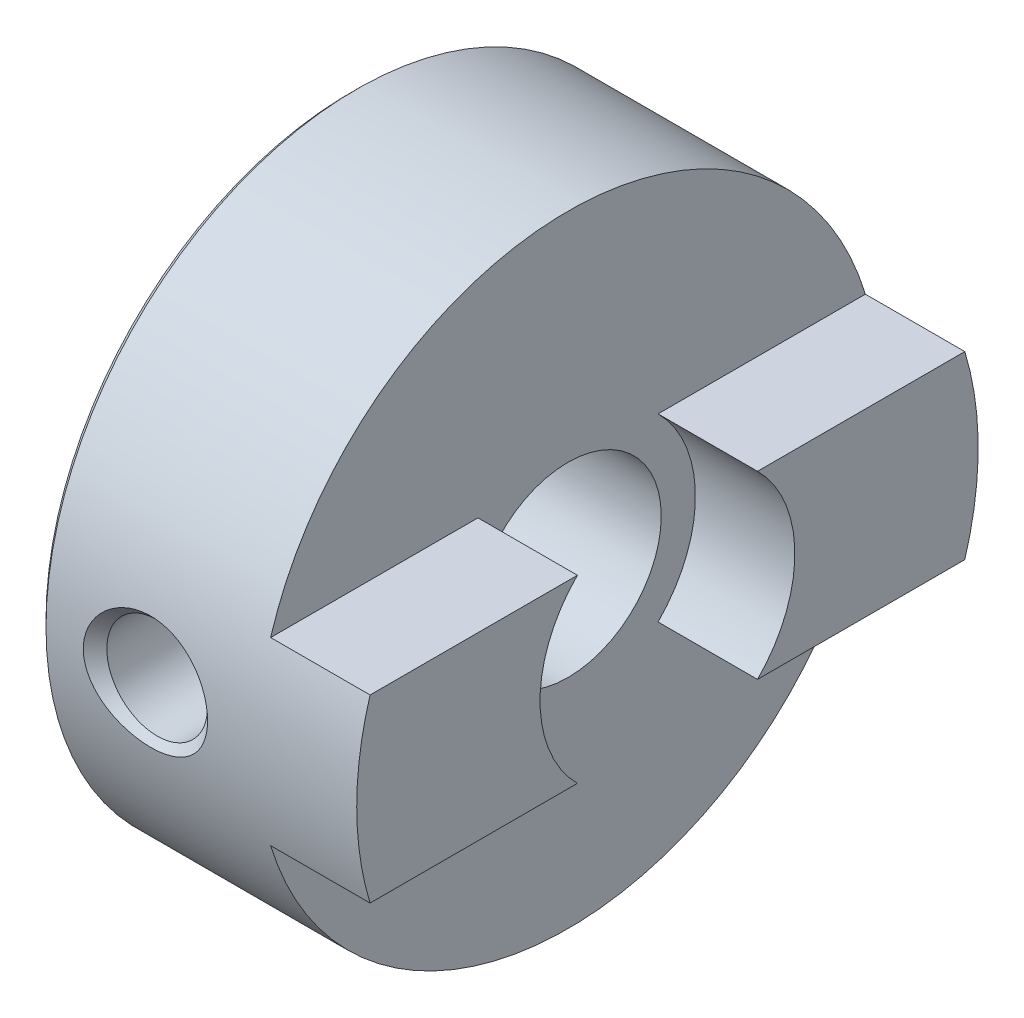
ISO-10303-21;
HEADER;
FILE_DESCRIPTION(('STEP AP214'),'2;1');
FILE_NAME('part.step','',(''),(''),'','','');
FILE_SCHEMA(('AUTOMOTIVE_DESIGN { 1 0 10303 214 1 1 1 1 }'));
ENDSEC;
DATA;
#1=APPLICATION_CONTEXT('core data for automotive mechanical design processes');
#2=APPLICATION_PROTOCOL_DEFINITION('international standard','automotive_design',2000,#1);
#3=PRODUCT_CONTEXT('',#1,'mechanical');
#4=PRODUCT('Part','Part','',(#3));
#5=PRODUCT_RELATED_PRODUCT_CATEGORY('part','',(#4));
#6=PRODUCT_DEFINITION_FORMATION('','',#4);
#7=PRODUCT_DEFINITION_CONTEXT('part definition',#1,'design');
#8=PRODUCT_DEFINITION('design','',#6,#7);
#9=PRODUCT_DEFINITION_SHAPE('','',#8);
#10=(LENGTH_UNIT() NAMED_UNIT(*) SI_UNIT(.MILLI.,.METRE.));
#11=(NAMED_UNIT(*) PLANE_ANGLE_UNIT() SI_UNIT($,.RADIAN.));
#12=(NAMED_UNIT(*) SI_UNIT($,.STERADIAN.) SOLID_ANGLE_UNIT());
#13=UNCERTAINTY_MEASURE_WITH_UNIT(LENGTH_MEASURE(1.E-05),#10,'distance_accuracy_value','');
#14=(GEOMETRIC_REPRESENTATION_CONTEXT(3) GLOBAL_UNCERTAINTY_ASSIGNED_CONTEXT((#13)) GLOBAL_UNIT_ASSIGNED_CONTEXT((#10,
#11,#12)) REPRESENTATION_CONTEXT('',''));
#15=CARTESIAN_POINT('',(0.,0.,0.));
#16=DIRECTION('',(0.,0.,1.));
#17=DIRECTION('',(1.,0.,0.));
#18=AXIS2_PLACEMENT_3D('',#15,#16,#17);
#19=CARTESIAN_POINT('',(10.2,0.,0.));
#20=DIRECTION('',(-1.,0.,0.));
#21=DIRECTION('',(0.,0.,1.));
#22=AXIS2_PLACEMENT_3D('',#19,#20,#21);
#23=CYLINDRICAL_SURFACE('',#22,10.);
#24=CARTESIAN_POINT('',(2.04203605263134,-1.34241325962392,9.90948670710666));
#25=CARTESIAN_POINT('',(2.11375542397122,-1.403240523465,9.90124691995362));
#26=CARTESIAN_POINT('',(2.18989182528834,-1.45890211933818,9.89313764082208));
#27=CARTESIAN_POINT('',(2.34925532035735,-1.55916960172842,9.8778320646358));
#28=CARTESIAN_POINT('',(2.43248860925503,-1.60376569319462,9.87063657919076));
#29=CARTESIAN_POINT('',(2.6219925848851,-1.68930210928572,9.85639502389072));
#30=CARTESIAN_POINT('',(2.72948553219465,-1.72761385701575,9.84968268006661));
#31=CARTESIAN_POINT('',(2.94933651346637,-1.78669335920088,9.83913761976317));
#32=CARTESIAN_POINT('',(3.0616966654432,-1.80745339356143,9.83530617052286));
#33=CARTESIAN_POINT('',(3.29308990862618,-1.83156785115371,9.83084559805247));
#34=CARTESIAN_POINT('',(3.41220590990035,-1.8341605770526,9.83035663452192));
#35=CARTESIAN_POINT('',(3.64922601441559,-1.81986799512386,9.83301223260815));
#36=CARTESIAN_POINT('',(3.76713003270237,-1.80298133114981,9.83615704720695));
#37=CARTESIAN_POINT('',(3.9996034290027,-1.7497602257805,9.84576428779239));
#38=CARTESIAN_POINT('',(4.11412681675671,-1.7132301395102,9.85226006178363));
#39=CARTESIAN_POINT('',(4.33516048902334,-1.62125375202364,9.86781136761335));
#40=CARTESIAN_POINT('',(4.44167025728316,-1.56580623338128,9.8768670641885));
#41=CARTESIAN_POINT('',(4.64111082233285,-1.43837265465425,9.89621846873361));
#42=CARTESIAN_POINT('',(4.7342751492373,-1.36674877708146,9.90648496446691));
#43=CARTESIAN_POINT('',(4.90614866938823,-1.20782961406183,9.92711143478405));
#44=CARTESIAN_POINT('',(4.98486323457534,-1.12054017651392,9.93747137312015));
#45=CARTESIAN_POINT('',(5.11980395338148,-0.938642082082796,9.95624141112421));
#46=CARTESIAN_POINT('',(5.17716449208623,-0.844885941486473,9.96473473462322));
#47=CARTESIAN_POINT('',(5.27349691200858,-0.648199010207064,9.97945483045475));
#48=CARTESIAN_POINT('',(5.3124837120208,-0.545275743915212,9.98568344070818));
#49=CARTESIAN_POINT('',(5.3671729789784,-0.343874247360195,9.9945446223789));
#50=CARTESIAN_POINT('',(5.38474953322585,-0.245915988420423,9.99746472104146));
#51=CARTESIAN_POINT('',(5.4022361149181,-0.0484041411381668,10.0003695536457));
#52=CARTESIAN_POINT('',(5.40215363738717,0.0511487524536561,10.000355532916));
#53=CARTESIAN_POINT('',(5.38489896220358,0.242476170784844,9.99748983101426));
#54=CARTESIAN_POINT('',(5.36878332134464,0.334351156623259,9.99481358692744));
#55=CARTESIAN_POINT('',(5.32176601831496,0.51412060714981,9.98718069962873));
#56=CARTESIAN_POINT('',(5.29086388026823,0.602014943628468,9.98222398302425));
#57=CARTESIAN_POINT('',(5.21493293386297,0.773019711530929,9.97045207609644));
#58=CARTESIAN_POINT('',(5.1696839939923,0.856029931496645,9.9636081583261));
#59=CARTESIAN_POINT('',(5.06689422375728,1.01392340385955,9.9487818170687));
#60=CARTESIAN_POINT('',(5.00934989283831,1.08880433263463,9.94079906956711));
#61=CARTESIAN_POINT('',(4.87894894150659,1.23447162688709,9.9238030932501));
#62=CARTESIAN_POINT('',(4.80525754097539,1.3045061687632,9.91475775416407));
#63=CARTESIAN_POINT('',(4.64794441919632,1.43240822380913,9.89708970173511));
#64=CARTESIAN_POINT('',(4.5643189231435,1.49027108863773,9.88846715081479));
#65=CARTESIAN_POINT('',(4.38153418471773,1.59752765702108,9.8717333045712));
#66=CARTESIAN_POINT('',(4.28165500297367,1.64571393946365,9.86373530170333));
#67=CARTESIAN_POINT('',(4.0754385309667,1.72585895137402,9.85002883016572));
#68=CARTESIAN_POINT('',(3.96909936359708,1.75781293865579,9.84432103066997));
#69=CARTESIAN_POINT('',(3.74621625177177,1.80638838383251,9.83552836788217));
#70=CARTESIAN_POINT('',(3.62944128411396,1.82198683566234,9.83261936137998));
#71=CARTESIAN_POINT('',(3.39486487494573,1.83412123663999,9.83036296012612));
#72=CARTESIAN_POINT('',(3.27706327585451,1.83065420601992,9.83101612211003));
#73=CARTESIAN_POINT('',(3.04119864761494,1.80444216325199,9.83586147731257));
#74=CARTESIAN_POINT('',(2.92318121054954,1.78129740459865,9.84012704833762));
#75=CARTESIAN_POINT('',(2.69280878150543,1.71561219037197,9.8517906665897));
#76=CARTESIAN_POINT('',(2.58045431638512,1.67306993382479,9.85918900467606));
#77=CARTESIAN_POINT('',(2.36581493938337,1.56983517700697,9.87614901728429));
#78=CARTESIAN_POINT('',(2.26344879419886,1.50930878895272,9.88569070578194));
#79=CARTESIAN_POINT('',(2.07108333350251,1.37112070640718,9.90580054499222));
#80=CARTESIAN_POINT('',(1.981081936517,1.29346190172542,9.91636852242754));
#81=CARTESIAN_POINT('',(1.82099876692076,1.12690342645504,9.93663756302797));
#82=CARTESIAN_POINT('',(1.75016033608861,1.03873541573407,9.94635578054492));
#83=CARTESIAN_POINT('',(1.62601158238275,0.850665231116957,9.96419833690671));
#84=CARTESIAN_POINT('',(1.57268827734222,0.750771822939427,9.97232385444711));
#85=CARTESIAN_POINT('',(1.49029274114702,0.551870768735924,9.98521137796381));
#86=CARTESIAN_POINT('',(1.45945480092119,0.453610249008211,9.99021223200516));
#87=CARTESIAN_POINT('',(1.41614576973022,0.253033165393579,9.99730024771955));
#88=CARTESIAN_POINT('',(1.40366301836498,0.150719218970854,9.99938925913892));
#89=CARTESIAN_POINT('',(1.39796920562316,-0.0460911958730754,10.0003387207038));
#90=CARTESIAN_POINT('',(1.40327326406868,-0.140546655337177,9.99944794550816));
#91=CARTESIAN_POINT('',(1.42967176301348,-0.327159425861631,9.9950825821691));
#92=CARTESIAN_POINT('',(1.45076629170412,-0.419316724083549,9.99160797959474));
#93=CARTESIAN_POINT('',(1.5074595833349,-0.597749488664115,9.98251470494415));
#94=CARTESIAN_POINT('',(1.54289103337312,-0.684079834897608,9.97692081156793));
#95=CARTESIAN_POINT('',(1.62683683955861,-0.849951171873044,9.96416112679107));
#96=CARTESIAN_POINT('',(1.67534805042054,-0.92949378881176,9.95699571337045));
#97=CARTESIAN_POINT('',(1.77446616135076,-1.06727958089582,9.94308117256719));
#98=CARTESIAN_POINT('',(1.82328764631752,-1.12683634457346,9.93647131377168));
#99=CARTESIAN_POINT('',(1.92776912327518,-1.23954884818016,9.92304079303933));
#100=CARTESIAN_POINT('',(1.98342774504566,-1.29270586645815,9.91622017354513));
#101=CARTESIAN_POINT('',(2.04203605263134,-1.34241325962392,9.90948670710666));
#102=B_SPLINE_CURVE_WITH_KNOTS('',3,(#24,#25,#26,#27,#28,#29,#30,#31,#32,#33,#34,#35,#36,#37,
#38,#39,#40,#41,#42,#43,#44,#45,#46,#47,#48,#49,#50,#51,#52,#53,#54,#55,#56,#57,#58,#59,#60,#61,
#62,#63,#64,#65,#66,#67,#68,#69,#70,#71,#72,#73,#74,#75,#76,#77,#78,#79,#80,#81,#82,#83,#84,#85,
#86,#87,#88,#89,#90,#91,#92,#93,#94,#95,#96,#97,#98,#99,#100,#101),.UNSPECIFIED.,.T.,.F.,(4,2,2,
2,2,2,2,2,2,2,2,2,2,2,2,2,2,2,2,2,2,2,2,2,2,2,2,2,2,2,2,2,2,2,2,2,2,2,4),(0.,0.282999987596324,
0.566249596778663,0.907629818392951,1.24916011757754,1.60492837412329,1.9607214005912,
2.3201255333534,2.6795527998328,3.03161485312538,3.38354575521571,3.7124512028387,
4.04108912935102,4.33821745723761,4.63521967517437,4.91386546974415,5.19252023261509,
5.47567624116556,5.75891297321336,6.06382400948452,6.36885128016056,6.70095008860706,
7.0331458623877,7.38506553177243,7.73704020468186,8.0963408157774,8.45567479317689,
8.81178779539873,9.16784077614117,9.5065530851701,9.84501377199465,10.1526644919369,
10.4601196877335,10.7425680964228,11.0250180826268,11.3042627819106,11.5834403911198,
11.8147512527918,12.0460158331962),.UNSPECIFIED.);
#103=CARTESIAN_POINT('',(2.04203605263134,-1.34241325962392,9.90948670710666));
#104=VERTEX_POINT('',#103);
#105=EDGE_CURVE('E43',#104,#104,#102,.T.);
#106=ORIENTED_EDGE('',*,*,#105,.F.);
#107=EDGE_LOOP('',(#106));
#108=FACE_BOUND('',#107,.T.);
#109=CARTESIAN_POINT('',(0.200000000000001,0.,0.));
#110=DIRECTION('',(-1.,0.,0.));
#111=DIRECTION('',(0.,0.,1.));
#112=AXIS2_PLACEMENT_3D('',#109,#110,#111);
#113=CIRCLE('',#112,10.);
#114=CARTESIAN_POINT('',(0.200000000000001,0.,10.));
#115=VERTEX_POINT('',#114);
#116=EDGE_CURVE('E144',#115,#115,#113,.T.);
#117=ORIENTED_EDGE('',*,*,#116,.F.);
#118=EDGE_LOOP('',(#117));
#119=FACE_BOUND('',#118,.T.);
#120=DIRECTION('',(-1.,0.,0.));
#121=VECTOR('',#120,1.);
#122=CARTESIAN_POINT('',(10.2,2.9,-9.57026645397086));
#123=LINE('',#122,#121);
#124=CARTESIAN_POINT('',(10.2,2.9,-9.57026645397086));
#125=VERTEX_POINT('',#124);
#126=CARTESIAN_POINT('',(7.,2.9,-9.57026645397086));
#127=VERTEX_POINT('',#126);
#128=EDGE_CURVE('E129',#125,#127,#123,.T.);
#129=ORIENTED_EDGE('',*,*,#128,.F.);
#130=CARTESIAN_POINT('',(10.2,0.,0.));
#131=DIRECTION('',(-1.,0.,0.));
#132=DIRECTION('',(0.,0.,1.));
#133=AXIS2_PLACEMENT_3D('',#130,#131,#132);
#134=CIRCLE('',#133,10.);
#135=CARTESIAN_POINT('',(10.2,-2.9,-9.57026645397086));
#136=VERTEX_POINT('',#135);
#137=EDGE_CURVE('E111',#125,#136,#134,.T.);
#138=ORIENTED_EDGE('',*,*,#137,.T.);
#139=DIRECTION('',(-1.,0.,0.));
#140=VECTOR('',#139,1.);
#141=CARTESIAN_POINT('',(10.2,-2.9,-9.57026645397086));
#142=LINE('',#141,#140);
#143=CARTESIAN_POINT('',(7.,-2.9,-9.57026645397086));
#144=VERTEX_POINT('',#143);
#145=EDGE_CURVE('E127',#144,#136,#142,.F.);
#146=ORIENTED_EDGE('',*,*,#145,.F.);
#147=CARTESIAN_POINT('',(7.,0.,0.));
#148=DIRECTION('',(1.,0.,0.));
#149=DIRECTION('',(0.,0.,-1.));
#150=AXIS2_PLACEMENT_3D('',#147,#148,#149);
#151=CIRCLE('',#150,10.);
#152=CARTESIAN_POINT('',(7.,-2.9,9.57026645397086));
#153=VERTEX_POINT('',#152);
#154=EDGE_CURVE('E125',#153,#144,#151,.T.);
#155=ORIENTED_EDGE('',*,*,#154,.F.);
#156=DIRECTION('',(-1.,0.,0.));
#157=VECTOR('',#156,1.);
#158=CARTESIAN_POINT('',(10.2,-2.9,9.57026645397086));
#159=LINE('',#158,#157);
#160=CARTESIAN_POINT('',(10.2,-2.9,9.57026645397086));
#161=VERTEX_POINT('',#160);
#162=EDGE_CURVE('E115',#161,#153,#159,.T.);
#163=ORIENTED_EDGE('',*,*,#162,.F.);
#164=CARTESIAN_POINT('',(10.2,2.9,9.57026645397086));
#165=VERTEX_POINT('',#164);
#166=EDGE_CURVE('E101',#161,#165,#134,.T.);
#167=ORIENTED_EDGE('',*,*,#166,.T.);
#168=DIRECTION('',(-1.,0.,0.));
#169=VECTOR('',#168,1.);
#170=CARTESIAN_POINT('',(10.2,2.9,9.57026645397086));
#171=LINE('',#170,#169);
#172=CARTESIAN_POINT('',(7.,2.9,9.57026645397086));
#173=VERTEX_POINT('',#172);
#174=EDGE_CURVE('E126',#173,#165,#171,.F.);
#175=ORIENTED_EDGE('',*,*,#174,.F.);
#176=EDGE_CURVE('E136',#127,#173,#151,.T.);
#177=ORIENTED_EDGE('',*,*,#176,.F.);
#178=EDGE_LOOP('',(#129,#138,#146,#155,#163,#167,#175,#177));
#179=FACE_BOUND('',#178,.T.);
#180=CARTESIAN_POINT('',(2.04203605263134,-9.90948670710666,-1.34241325962392));
#181=CARTESIAN_POINT('',(2.11375542397122,-9.90124691995362,-1.403240523465));
#182=CARTESIAN_POINT('',(2.18989182528834,-9.89313764082208,-1.45890211933818));
#183=CARTESIAN_POINT('',(2.34925532035735,-9.8778320646358,-1.55916960172842));
#184=CARTESIAN_POINT('',(2.43248860925503,-9.87063657919076,-1.60376569319462));
#185=CARTESIAN_POINT('',(2.6219925848851,-9.85639502389072,-1.68930210928572));
#186=CARTESIAN_POINT('',(2.72948553219465,-9.84968268006661,-1.72761385701576));
#187=CARTESIAN_POINT('',(2.94933651346637,-9.83913761976317,-1.78669335920088));
#188=CARTESIAN_POINT('',(3.0616966654432,-9.83530617052286,-1.80745339356143));
#189=CARTESIAN_POINT('',(3.29308990862618,-9.83084559805247,-1.83156785115371));
#190=CARTESIAN_POINT('',(3.41220590990035,-9.83035663452193,-1.8341605770526));
#191=CARTESIAN_POINT('',(3.64922601441559,-9.83301223260815,-1.81986799512386));
#192=CARTESIAN_POINT('',(3.76713003270237,-9.83615704720695,-1.80298133114981));
#193=CARTESIAN_POINT('',(3.9996034290027,-9.84576428779239,-1.7497602257805));
#194=CARTESIAN_POINT('',(4.11412681675671,-9.85226006178363,-1.7132301395102));
#195=CARTESIAN_POINT('',(4.33516048902334,-9.86781136761335,-1.62125375202364));
#196=CARTESIAN_POINT('',(4.44167025728316,-9.8768670641885,-1.56580623338127));
#197=CARTESIAN_POINT('',(4.64111082233285,-9.89621846873361,-1.43837265465425));
#198=CARTESIAN_POINT('',(4.7342751492373,-9.90648496446691,-1.36674877708145));
#199=CARTESIAN_POINT('',(4.90614866938823,-9.92711143478405,-1.20782961406183));
#200=CARTESIAN_POINT('',(4.98486323457534,-9.93747137312015,-1.12054017651392));
#201=CARTESIAN_POINT('',(5.11980395338148,-9.95624141112421,-0.938642082082795));
#202=CARTESIAN_POINT('',(5.17716449208623,-9.96473473462322,-0.844885941486473));
#203=CARTESIAN_POINT('',(5.27349691200858,-9.97945483045475,-0.648199010207063));
#204=CARTESIAN_POINT('',(5.3124837120208,-9.98568344070818,-0.54527574391521));
#205=CARTESIAN_POINT('',(5.3671729789784,-9.9945446223789,-0.343874247360193));
#206=CARTESIAN_POINT('',(5.38474953322585,-9.99746472104146,-0.245915988420421));
#207=CARTESIAN_POINT('',(5.4022361149181,-10.0003695536457,-0.0484041411381657));
#208=CARTESIAN_POINT('',(5.40215363738717,-10.000355532916,0.0511487524536571));
#209=CARTESIAN_POINT('',(5.38489896220358,-9.99748983101426,0.242476170784845));
#210=CARTESIAN_POINT('',(5.36878332134464,-9.99481358692744,0.33435115662326));
#211=CARTESIAN_POINT('',(5.32176601831496,-9.98718069962873,0.514120607149811));
#212=CARTESIAN_POINT('',(5.29086388026823,-9.98222398302425,0.602014943628468));
#213=CARTESIAN_POINT('',(5.21493293386297,-9.97045207609644,0.77301971153093));
#214=CARTESIAN_POINT('',(5.1696839939923,-9.9636081583261,0.856029931496645));
#215=CARTESIAN_POINT('',(5.06689422375728,-9.9487818170687,1.01392340385955));
#216=CARTESIAN_POINT('',(5.00934989283831,-9.94079906956711,1.08880433263462));
#217=CARTESIAN_POINT('',(4.87894894150659,-9.9238030932501,1.23447162688709));
#218=CARTESIAN_POINT('',(4.80525754097539,-9.91475775416407,1.30450616876321));
#219=CARTESIAN_POINT('',(4.64794441919632,-9.89708970173511,1.43240822380913));
#220=CARTESIAN_POINT('',(4.5643189231435,-9.88846715081479,1.49027108863773));
#221=CARTESIAN_POINT('',(4.38153418471773,-9.87173330457119,1.59752765702109));
#222=CARTESIAN_POINT('',(4.28165500297367,-9.86373530170333,1.64571393946365));
#223=CARTESIAN_POINT('',(4.0754385309667,-9.85002883016572,1.72585895137402));
#224=CARTESIAN_POINT('',(3.96909936359708,-9.84432103066997,1.75781293865579));
#225=CARTESIAN_POINT('',(3.74621625177177,-9.83552836788217,1.80638838383251));
#226=CARTESIAN_POINT('',(3.62944128411395,-9.83261936137998,1.82198683566234));
#227=CARTESIAN_POINT('',(3.39486487494573,-9.83036296012612,1.83412123663999));
#228=CARTESIAN_POINT('',(3.27706327585451,-9.83101612211003,1.83065420601992));
#229=CARTESIAN_POINT('',(3.04119864761494,-9.83586147731257,1.80444216325199));
#230=CARTESIAN_POINT('',(2.92318121054954,-9.84012704833762,1.78129740459865));
#231=CARTESIAN_POINT('',(2.69280878150543,-9.8517906665897,1.71561219037198));
#232=CARTESIAN_POINT('',(2.58045431638512,-9.85918900467606,1.67306993382479));
#233=CARTESIAN_POINT('',(2.36581493938337,-9.87614901728429,1.56983517700697));
#234=CARTESIAN_POINT('',(2.26344879419886,-9.88569070578194,1.50930878895272));
#235=CARTESIAN_POINT('',(2.07108333350251,-9.90580054499222,1.37112070640718));
#236=CARTESIAN_POINT('',(1.981081936517,-9.91636852242754,1.29346190172542));
#237=CARTESIAN_POINT('',(1.82099876692076,-9.93663756302797,1.12690342645504));
#238=CARTESIAN_POINT('',(1.75016033608861,-9.94635578054492,1.03873541573407));
#239=CARTESIAN_POINT('',(1.62601158238275,-9.96419833690671,0.850665231116957));
#240=CARTESIAN_POINT('',(1.57268827734222,-9.97232385444711,0.750771822939427));
#241=CARTESIAN_POINT('',(1.49029274114702,-9.98521137796381,0.551870768735924));
#242=CARTESIAN_POINT('',(1.45945480092119,-9.99021223200516,0.453610249008211));
#243=CARTESIAN_POINT('',(1.41614576973022,-9.99730024771955,0.253033165393579));
#244=CARTESIAN_POINT('',(1.40366301836498,-9.99938925913892,0.150719218970854));
#245=CARTESIAN_POINT('',(1.39796920562316,-10.0003387207038,-0.046091195873075));
#246=CARTESIAN_POINT('',(1.40327326406869,-9.99944794550816,-0.140546655337177));
#247=CARTESIAN_POINT('',(1.42967176301348,-9.9950825821691,-0.327159425861631));
#248=CARTESIAN_POINT('',(1.45076629170412,-9.99160797959474,-0.419316724083548));
#249=CARTESIAN_POINT('',(1.5074595833349,-9.98251470494415,-0.597749488664114));
#250=CARTESIAN_POINT('',(1.54289103337312,-9.97692081156793,-0.684079834897607));
#251=CARTESIAN_POINT('',(1.62683683955861,-9.96416112679107,-0.849951171873043));
#252=CARTESIAN_POINT('',(1.67534805042054,-9.95699571337045,-0.929493788811759));
#253=CARTESIAN_POINT('',(1.77446616135076,-9.94308117256719,-1.06727958089582));
#254=CARTESIAN_POINT('',(1.82328764631752,-9.93647131377168,-1.12683634457346));
#255=CARTESIAN_POINT('',(1.92776912327518,-9.92304079303933,-1.23954884818016));
#256=CARTESIAN_POINT('',(1.98342774504567,-9.91622017354513,-1.29270586645815));
#257=CARTESIAN_POINT('',(2.04203605263134,-9.90948670710666,-1.34241325962392));
#258=B_SPLINE_CURVE_WITH_KNOTS('',3,(#180,#181,#182,#183,#184,#185,#186,#187,#188,#189,#190,
#191,#192,#193,#194,#195,#196,#197,#198,#199,#200,#201,#202,#203,#204,#205,#206,#207,#208,#209,
#210,#211,#212,#213,#214,#215,#216,#217,#218,#219,#220,#221,#222,#223,#224,#225,#226,#227,#228,
#229,#230,#231,#232,#233,#234,#235,#236,#237,#238,#239,#240,#241,#242,#243,#244,#245,#246,#247,
#248,#249,#250,#251,#252,#253,#254,#255,#256,#257),.UNSPECIFIED.,.T.,.F.,(4,2,2,2,2,2,2,2,2,2,2,
2,2,2,2,2,2,2,2,2,2,2,2,2,2,2,2,2,2,2,2,2,2,2,2,2,2,2,4),(0.,0.282999987596324,
0.566249596778662,0.907629818392951,1.24916011757755,1.60492837412329,1.9607214005912,
2.3201255333534,2.67955279983281,3.03161485312538,3.38354575521571,3.7124512028387,
4.04108912935102,4.33821745723761,4.63521967517437,4.91386546974415,5.19252023261509,
5.47567624116556,5.75891297321336,6.06382400948452,6.36885128016056,6.70095008860706,
7.0331458623877,7.38506553177243,7.73704020468186,8.09634081577739,8.45567479317689,
8.81178779539872,9.16784077614116,9.5065530851701,9.84501377199464,10.1526644919369,
10.4601196877335,10.7425680964228,11.0250180826268,11.3042627819106,11.5834403911198,
11.8147512527918,12.0460158331962),.UNSPECIFIED.);
#259=CARTESIAN_POINT('',(2.04203605263134,-9.90948670710666,-1.34241325962392));
#260=VERTEX_POINT('',#259);
#261=EDGE_CURVE('E11',#260,#260,#258,.T.);
#262=ORIENTED_EDGE('',*,*,#261,.F.);
#263=EDGE_LOOP('',(#262));
#264=FACE_BOUND('',#263,.T.);
#265=ADVANCED_FACE('F31',(#108,#119,#179,#264),#23,.T.);
#266=CARTESIAN_POINT('',(10.2,0.,0.));
#267=DIRECTION('',(-1.,0.,0.));
#268=DIRECTION('',(0.,0.,1.));
#269=AXIS2_PLACEMENT_3D('',#266,#267,#268);
#270=CYLINDRICAL_SURFACE('',#269,3.);
#271=CARTESIAN_POINT('',(5.021,0.,3.));
#272=CARTESIAN_POINT('',(5.02099457109827,-0.0843731660588239,2.9999951319355));
#273=CARTESIAN_POINT('',(5.01437433669201,-0.168821095406452,2.99640396378724));
#274=CARTESIAN_POINT('',(4.98821198475384,-0.33516790501757,2.98239149716802));
#275=CARTESIAN_POINT('',(4.96865084518123,-0.417062846766812,2.97196014440092));
#276=CARTESIAN_POINT('',(4.91762117905962,-0.575655188256636,2.94534591388916));
#277=CARTESIAN_POINT('',(4.88620122050288,-0.652372303111556,2.92918651166998));
#278=CARTESIAN_POINT('',(4.81262761689815,-0.799300997520425,2.89255245782874));
#279=CARTESIAN_POINT('',(4.77047374725153,-0.869512440906385,2.87207771591315));
#280=CARTESIAN_POINT('',(4.67343502088609,-1.00674459624371,2.82701708621452));
#281=CARTESIAN_POINT('',(4.61788475575182,-1.07323338719737,2.80224734273319));
#282=CARTESIAN_POINT('',(4.49708636614411,-1.19645221213792,2.7518977126203));
#283=CARTESIAN_POINT('',(4.4318296071323,-1.25317345934269,2.72631712079558));
#284=CARTESIAN_POINT('',(4.28614036605263,-1.36064006112414,2.67442425751036));
#285=CARTESIAN_POINT('',(4.20485727977529,-1.41031849069089,2.64827021966971));
#286=CARTESIAN_POINT('',(4.03357669961431,-1.49510260003812,2.60135150595308));
#287=CARTESIAN_POINT('',(3.94358608217119,-1.53021966511237,2.58058262429027));
#288=CARTESIAN_POINT('',(3.76309788583593,-1.58242014440552,2.54888864141375));
#289=CARTESIAN_POINT('',(3.6729876647943,-1.60049828148644,2.53742688515303));
#290=CARTESIAN_POINT('',(3.49034942506225,-1.62107745511865,2.52433661416084));
#291=CARTESIAN_POINT('',(3.39782479163051,-1.62359923678311,2.522695003903));
#292=CARTESIAN_POINT('',(3.22752159004787,-1.61371947649286,2.52901515631205));
#293=CARTESIAN_POINT('',(3.14955576591192,-1.60343533998463,2.53561473613387));
#294=CARTESIAN_POINT('',(2.99669485299723,-1.57196632726318,2.55524219197607));
#295=CARTESIAN_POINT('',(2.92180107940519,-1.55077683383754,2.56827279072563));
#296=CARTESIAN_POINT('',(2.7751152650984,-1.49779228244781,2.59953394198841));
#297=CARTESIAN_POINT('',(2.70342853466955,-1.46577291464061,2.61787318120727));
#298=CARTESIAN_POINT('',(2.5660790241851,-1.39222584201616,2.65771617985998));
#299=CARTESIAN_POINT('',(2.5004189068076,-1.35069396243738,2.67922132723298));
#300=CARTESIAN_POINT('',(2.36652125412236,-1.25199318053333,2.72689349902494));
#301=CARTESIAN_POINT('',(2.29939902950335,-1.19340874138073,2.75327334090615));
#302=CARTESIAN_POINT('',(2.17542257723792,-1.06581887986375,2.80513385605101));
#303=CARTESIAN_POINT('',(2.1185749276902,-0.996806832963454,2.8306139449258));
#304=CARTESIAN_POINT('',(2.01334798024756,-0.844920374420092,2.87973308329469));
#305=CARTESIAN_POINT('',(1.96572203952122,-0.761448464316124,2.90315688291725));
#306=CARTESIAN_POINT('',(1.88560551547091,-0.58610296363809,2.94356058915505));
#307=CARTESIAN_POINT('',(1.85310111776326,-0.494237133559179,2.96054637462064));
#308=CARTESIAN_POINT('',(1.80716774192039,-0.313680805141728,2.98481682961584));
#309=CARTESIAN_POINT('',(1.79226844404568,-0.225465833519945,2.99284546232958));
#310=CARTESIAN_POINT('',(1.77723854138022,-0.0474423896023515,3.00094475113755));
#311=CARTESIAN_POINT('',(1.77709903024854,0.0423650890180769,3.00102020633289));
#312=CARTESIAN_POINT('',(1.79088772182801,0.212039890799765,2.99358936971325));
#313=CARTESIAN_POINT('',(1.80350006418991,0.292050644093839,2.9867922540702));
#314=CARTESIAN_POINT('',(1.84024120576127,0.448621232917831,2.96731600589222));
#315=CARTESIAN_POINT('',(1.86437118897367,0.525180712774243,2.95463626863293));
#316=CARTESIAN_POINT('',(1.92390500734162,0.674855777750465,2.92413196679279));
#317=CARTESIAN_POINT('',(1.95956502216395,0.747844958496579,2.90619145137588));
#318=CARTESIAN_POINT('',(2.04082319788773,0.887006070481163,2.86678543403183));
#319=CARTESIAN_POINT('',(2.08642513824826,0.953175394999324,2.84531859232615));
#320=CARTESIAN_POINT('',(2.19199056477955,1.0845324500647,2.79806681031416));
#321=CARTESIAN_POINT('',(2.25297991473388,1.14881912119638,2.77206643567136));
#322=CARTESIAN_POINT('',(2.3846764055889,1.26672094827697,2.72021598653171));
#323=CARTESIAN_POINT('',(2.45539291609463,1.32032569154478,2.69436608230508));
#324=CARTESIAN_POINT('',(2.61075714326203,1.41908451269566,2.64376529084315));
#325=CARTESIAN_POINT('',(2.69603983842175,1.46335855995397,2.61922566046657));
#326=CARTESIAN_POINT('',(2.87453096570723,1.53648609196022,2.57701644321614));
#327=CARTESIAN_POINT('',(2.96772774741175,1.56536180376216,2.55933696401348));
#328=CARTESIAN_POINT('',(3.14978736849719,1.60400256447896,2.53528109424762));
#329=CARTESIAN_POINT('',(3.23818394126017,1.61535919756718,2.52796908972572));
#330=CARTESIAN_POINT('',(3.41588935867511,1.62335496406688,2.52284575195667));
#331=CARTESIAN_POINT('',(3.50519746802916,1.62000514850074,2.52502728486939));
#332=CARTESIAN_POINT('',(3.67005330963306,1.6002236370236,2.53759406566472));
#333=CARTESIAN_POINT('',(3.74590314620804,1.58551515346118,2.54689736268656));
#334=CARTESIAN_POINT('',(3.89390597061331,1.54582396093582,2.5711799470243));
#335=CARTESIAN_POINT('',(3.96605751892212,1.52083728493414,2.58616142575285));
#336=CARTESIAN_POINT('',(4.10973714271028,1.45958809953361,2.62124372211851));
#337=CARTESIAN_POINT('',(4.18093711127093,1.42271233322302,2.64160841202586));
#338=CARTESIAN_POINT('',(4.31661674955259,1.33932946529616,2.68484679786127));
#339=CARTESIAN_POINT('',(4.38109278453918,1.29281719466323,2.70772183722975));
#340=CARTESIAN_POINT('',(4.51157233164326,1.18336067801285,2.75749652134415));
#341=CARTESIAN_POINT('',(4.57635900332551,1.1189988263306,2.78448592407432));
#342=CARTESIAN_POINT('',(4.69460125439333,0.979791159316942,2.8364642263454));
#343=CARTESIAN_POINT('',(4.74804917665567,0.904938315649743,2.86145176697476));
#344=CARTESIAN_POINT('',(4.843330518114,0.743931042183106,2.90753732843009));
#345=CARTESIAN_POINT('',(4.88478951502625,0.657515318382211,2.92850420330813));
#346=CARTESIAN_POINT('',(4.95202048045974,0.477539433933994,2.96315523998461));
#347=CARTESIAN_POINT('',(4.97783366991903,0.383998784126169,2.97685852658942));
#348=CARTESIAN_POINT('',(5.00369412232057,0.24113455305292,2.99067721809069));
#349=CARTESIAN_POINT('',(5.01017076377589,0.193213707519882,2.99416035982787));
#350=CARTESIAN_POINT('',(5.01882526745889,0.0968701256885781,2.99882315173278));
#351=CARTESIAN_POINT('',(5.02100311729571,0.0484473879440588,3.00000279526087));
#352=CARTESIAN_POINT('',(5.021,0.,3.));
#353=B_SPLINE_CURVE_WITH_KNOTS('',3,(#271,#272,#273,#274,#275,#276,#277,#278,#279,#280,#281,
#282,#283,#284,#285,#286,#287,#288,#289,#290,#291,#292,#293,#294,#295,#296,#297,#298,#299,#300,
#301,#302,#303,#304,#305,#306,#307,#308,#309,#310,#311,#312,#313,#314,#315,#316,#317,#318,#319,
#320,#321,#322,#323,#324,#325,#326,#327,#328,#329,#330,#331,#332,#333,#334,#335,#336,#337,#338,
#339,#340,#341,#342,#343,#344,#345,#346,#347,#348,#349,#350,#351,#352),.UNSPECIFIED.,.T.,.F.,(4,
2,2,2,2,2,2,2,2,2,2,2,2,2,2,2,2,2,2,2,2,2,2,2,2,2,2,2,2,2,2,2,2,2,2,2,2,2,2,2,4),(0.,
0.25292421107096,0.506221027943178,0.75849152617458,1.01076730340149,1.2800048058544,
1.54948326048397,1.84435745228828,2.13900065002563,2.41512499026882,2.69088102630265,
2.92652527467427,3.16226937449706,3.40323014929639,3.64429687801128,3.92186770058098,
4.19961560783809,4.4947588387055,4.78963190750152,5.0575902341339,5.32538686860407,
5.56811116627653,5.81086042116018,6.05942380695504,6.3080818503033,6.58397097267654,
6.86012772855624,7.1560599631612,7.45156386381497,7.71819485129273,7.98462551573254,
8.21707064807343,8.44960558077257,8.69684895569373,8.94422529681473,9.22864208574413,
9.51325033585309,9.80596984094501,10.0979147472366,10.243144357871,10.3883743871158),.UNSPECIFIED.);
#354=CARTESIAN_POINT('',(5.021,0.,3.));
#355=VERTEX_POINT('',#354);
#356=EDGE_CURVE('E163',#355,#355,#353,.T.);
#357=ORIENTED_EDGE('',*,*,#356,.F.);
#358=EDGE_LOOP('',(#357));
#359=FACE_BOUND('',#358,.T.);
#360=CARTESIAN_POINT('',(0.,0.,0.));
#361=DIRECTION('',(-1.,0.,0.));
#362=DIRECTION('',(0.,0.,1.));
#363=AXIS2_PLACEMENT_3D('',#360,#361,#362);
#364=CIRCLE('',#363,3.);
#365=CARTESIAN_POINT('',(0.,0.,3.));
#366=VERTEX_POINT('',#365);
#367=EDGE_CURVE('E110',#366,#366,#364,.T.);
#368=ORIENTED_EDGE('',*,*,#367,.T.);
#369=EDGE_LOOP('',(#368));
#370=FACE_BOUND('',#369,.T.);
#371=CARTESIAN_POINT('',(7.,0.,0.));
#372=DIRECTION('',(1.,0.,0.));
#373=DIRECTION('',(0.,0.,-1.));
#374=AXIS2_PLACEMENT_3D('',#371,#372,#373);
#375=CIRCLE('',#374,3.);
#376=CARTESIAN_POINT('',(7.,0.,-3.));
#377=VERTEX_POINT('',#376);
#378=EDGE_CURVE('E146',#377,#377,#375,.F.);
#379=ORIENTED_EDGE('',*,*,#378,.F.);
#380=EDGE_LOOP('',(#379));
#381=FACE_BOUND('',#380,.T.);
#382=CARTESIAN_POINT('',(3.4,-2.52435318448113,-1.621));
#383=CARTESIAN_POINT('',(3.31664284722366,-2.52436186295701,-1.62099363894757));
#384=CARTESIAN_POINT('',(3.23320603802893,-2.52854687580237,-1.61452589624407));
#385=CARTESIAN_POINT('',(3.06898360278544,-2.54464255557962,-1.58902665314323));
#386=CARTESIAN_POINT('',(2.98820291259571,-2.55656683634379,-1.56997301235307));
#387=CARTESIAN_POINT('',(2.83199219195788,-2.5863363874651,-1.52042284687296));
#388=CARTESIAN_POINT('',(2.75653303851835,-2.60414580342385,-1.48999547138124));
#389=CARTESIAN_POINT('',(2.61181642082982,-2.64362127087021,-1.41877415379996));
#390=CARTESIAN_POINT('',(2.5425600908881,-2.66528802559181,-1.37797832084914));
#391=CARTESIAN_POINT('',(2.40479607080789,-2.7126008176913,-1.28253574620178));
#392=CARTESIAN_POINT('',(2.33701667561367,-2.73842891744053,-1.22692762745791));
#393=CARTESIAN_POINT('',(2.21116523446936,-2.78969198499118,-1.10542725433427));
#394=CARTESIAN_POINT('',(2.15309878985655,-2.81512671832321,-1.03952910788441));
#395=CARTESIAN_POINT('',(2.04363789970676,-2.86522545889692,-0.892732521909249));
#396=CARTESIAN_POINT('',(1.99318136179733,-2.88965513208665,-0.811047063046135));
#397=CARTESIAN_POINT('',(1.90706469504387,-2.93254453267806,-0.638777442621926));
#398=CARTESIAN_POINT('',(1.87139368261275,-2.95100864909488,-0.548199887474031));
#399=CARTESIAN_POINT('',(1.81888830664368,-2.97855948584726,-0.368468076517936));
#400=CARTESIAN_POINT('',(1.8007644382207,-2.98828354342539,-0.279790557533659));
#401=CARTESIAN_POINT('',(1.77957768783366,-2.9996737738824,-0.100166277641395));
#402=CARTESIAN_POINT('',(1.77650386882636,-3.00134579825147,-0.0092212129078698));
#403=CARTESIAN_POINT('',(1.78510797880688,-2.9967032305933,0.16247722642357));
#404=CARTESIAN_POINT('',(1.79532509716082,-2.99117944305056,0.243330932166298));
#405=CARTESIAN_POINT('',(1.82754525702917,-2.97401869168161,0.401968389023387));
#406=CARTESIAN_POINT('',(1.84954919796297,-2.96238126134176,0.479751905373811));
#407=CARTESIAN_POINT('',(1.90474994484451,-2.93386582306654,0.631225708039624));
#408=CARTESIAN_POINT('',(1.9380725900065,-2.91692907297974,0.70485861811728));
#409=CARTESIAN_POINT('',(2.0147322209885,-2.87927282526748,0.84563922454833));
#410=CARTESIAN_POINT('',(2.05807250436768,-2.85855208251756,0.912784775080174));
#411=CARTESIAN_POINT('',(2.1587478710569,-2.81262349070193,1.04624998714417));
#412=CARTESIAN_POINT('',(2.21707647415202,-2.78717289210212,1.11173684806185));
#413=CARTESIAN_POINT('',(2.34346124902551,-2.73592653636234,1.23248428656359));
#414=CARTESIAN_POINT('',(2.41152692871083,-2.71013046446062,1.28773474620293));
#415=CARTESIAN_POINT('',(2.56226262435972,-2.6587101289379,1.39099099599223));
#416=CARTESIAN_POINT('',(2.64567519129368,-2.63327689058161,1.43801833917534));
#417=CARTESIAN_POINT('',(2.82085045032804,-2.58856088720358,1.51704683606123));
#418=CARTESIAN_POINT('',(2.912603430425,-2.56927108345307,1.54906520602282));
#419=CARTESIAN_POINT('',(3.0941578056817,-2.5413651750779,1.59440421692534));
#420=CARTESIAN_POINT('',(3.18351390631785,-2.53201025435868,1.60903074555208));
#421=CARTESIAN_POINT('',(3.36386243257022,-2.52301246009169,1.62311178337913));
#422=CARTESIAN_POINT('',(3.45485306023086,-2.52335949863304,1.62258205175431));
#423=CARTESIAN_POINT('',(3.62242047207512,-2.53294112629222,1.60756227729203));
#424=CARTESIAN_POINT('',(3.69925489442919,-2.54094376186154,1.59500705950105));
#425=CARTESIAN_POINT('',(3.84952606882057,-2.56298697137751,1.559337733154));
#426=CARTESIAN_POINT('',(3.92296141245171,-2.57703002379561,1.53621929010926));
#427=CARTESIAN_POINT('',(4.06805067779605,-2.61025593783801,1.47908594944002));
#428=CARTESIAN_POINT('',(4.13948823681993,-2.62963576637781,1.44464089674888));
#429=CARTESIAN_POINT('',(4.27599665639695,-2.67123467475029,1.36619039780243));
#430=CARTESIAN_POINT('',(4.34106428477774,-2.69345518292444,1.32218013415053));
#431=CARTESIAN_POINT('',(4.47334107638031,-2.74227738511162,1.21807095309862));
#432=CARTESIAN_POINT('',(4.53937503077712,-2.76903198641388,1.15654377407784));
#433=CARTESIAN_POINT('',(4.66063137721435,-2.82109026325389,1.02302802884613));
#434=CARTESIAN_POINT('',(4.71584800361649,-2.84639315997977,0.951033919178577));
#435=CARTESIAN_POINT('',(4.81618926546581,-2.89411724318646,0.794403708814586));
#436=CARTESIAN_POINT('',(4.86074457267899,-2.91635635799974,0.709343130440002));
#437=CARTESIAN_POINT('',(4.93444188449614,-2.95395691540313,0.531391383163081));
#438=CARTESIAN_POINT('',(4.96359947119435,-2.96932530855919,0.438508241320595));
#439=CARTESIAN_POINT('',(5.00280698120644,-2.9901681228677,0.257572638026003));
#440=CARTESIAN_POINT('',(5.01447832975629,-2.99647940533321,0.169968257289049));
#441=CARTESIAN_POINT('',(5.02338117335472,-3.00128435840427,-0.00617006282732574));
#442=CARTESIAN_POINT('',(5.02061969948143,-2.99978183557653,-0.0947035286194599));
#443=CARTESIAN_POINT('',(5.00167892160387,-2.98959565983602,-0.262240355138677));
#444=CARTESIAN_POINT('',(4.98665362116957,-2.98152979747106,-0.341416671039581));
#445=CARTESIAN_POINT('',(4.94534117331473,-2.95975183134723,-0.495943829574025));
#446=CARTESIAN_POINT('',(4.91905263549361,-2.94603903050503,-0.571294198625161));
#447=CARTESIAN_POINT('',(4.85505143942416,-2.9135454372205,-0.719162111885178));
#448=CARTESIAN_POINT('',(4.81695861484051,-2.89459869843828,-0.791477439333819));
#449=CARTESIAN_POINT('',(4.73089861853938,-2.85345796251642,-0.928942460270501));
#450=CARTESIAN_POINT('',(4.68292729263754,-2.83126260037983,-0.994089121393011));
#451=CARTESIAN_POINT('',(4.57227923400835,-2.78277750722374,-1.12312764886385));
#452=CARTESIAN_POINT('',(4.50855582786714,-2.75630794444087,-1.18605606148366));
#453=CARTESIAN_POINT('',(4.37139387645949,-2.70406079578556,-1.30078394941853));
#454=CARTESIAN_POINT('',(4.29794428839518,-2.67828403712608,-1.35257059664679));
#455=CARTESIAN_POINT('',(4.13799046824114,-2.62885261084627,-1.44641313943317));
#456=CARTESIAN_POINT('',(4.05097134514694,-2.60541328224677,-1.48771340363927));
#457=CARTESIAN_POINT('',(3.86958606179356,-2.56615169392856,-1.55447585480261));
#458=CARTESIAN_POINT('',(3.77524484492052,-2.55030478826068,-1.57998936722577));
#459=CARTESIAN_POINT('',(3.6330608836757,-2.53467422353912,-1.60483772785892));
#460=CARTESIAN_POINT('',(3.58675008618045,-2.5308245339674,-1.61088486897433));
#461=CARTESIAN_POINT('',(3.49363457856728,-2.52566155424199,-1.61896782731833));
#462=CARTESIAN_POINT('',(3.44682985973145,-2.52434830893302,-1.62100357362485));
#463=CARTESIAN_POINT('',(3.4,-2.52435318448113,-1.621));
#464=B_SPLINE_CURVE_WITH_KNOTS('',3,(#382,#383,#384,#385,#386,#387,#388,#389,#390,#391,#392,
#393,#394,#395,#396,#397,#398,#399,#400,#401,#402,#403,#404,#405,#406,#407,#408,#409,#410,#411,
#412,#413,#414,#415,#416,#417,#418,#419,#420,#421,#422,#423,#424,#425,#426,#427,#428,#429,#430,
#431,#432,#433,#434,#435,#436,#437,#438,#439,#440,#441,#442,#443,#444,#445,#446,#447,#448,#449,
#450,#451,#452,#453,#454,#455,#456,#457,#458,#459,#460,#461,#462,#463),.UNSPECIFIED.,.T.,.F.,(4,
2,2,2,2,2,2,2,2,2,2,2,2,2,2,2,2,2,2,2,2,2,2,2,2,2,2,2,2,2,2,2,2,2,2,2,2,2,2,2,4),(0.,
0.249873122741378,0.500186982816321,0.749003121249092,0.997864668057241,1.27093663879588,
1.54416554783273,1.83980538375143,2.13522721181823,2.40677021289403,2.67811585124294,
2.92201256312263,3.16592788872848,3.41264895469638,3.65945135110145,3.93226377497119,
4.20534443217741,4.50103283658704,4.7963812323419,5.06777483033573,5.33888624898459,
5.57261861905035,5.80644698455107,6.05044438830387,6.29456496418211,6.57575585946414,
6.85709622421415,7.15115989631948,7.44492541056494,7.70926490574467,7.97347563758907,
8.2153514417872,8.45725711317052,8.70794678000813,8.9587420848964,9.23771680390217,
9.51701102203583,9.81280559062576,10.1076333560939,10.2480090289631,10.3883871836733),.UNSPECIFIED.);
#465=CARTESIAN_POINT('',(3.4,-2.52435318448113,-1.621));
#466=VERTEX_POINT('',#465);
#467=EDGE_CURVE('E228',#466,#466,#464,.T.);
#468=ORIENTED_EDGE('',*,*,#467,.F.);
#469=EDGE_LOOP('',(#468));
#470=FACE_BOUND('',#469,.T.);
#471=ADVANCED_FACE('F174',(#359,#370,#381,#470),#270,.F.);
#472=CARTESIAN_POINT('',(10.2,3.,0.));
#473=DIRECTION('',(-1.,0.,0.));
#474=DIRECTION('',(0.,0.,1.));
#475=AXIS2_PLACEMENT_3D('',#472,#473,#474);
#476=PLANE('',#475);
#477=DIRECTION('',(0.,0.,1.));
#478=VECTOR('',#477,1.);
#479=CARTESIAN_POINT('',(10.2,2.9,-10.));
#480=LINE('',#479,#478);
#481=CARTESIAN_POINT('',(10.2,2.9,2.89827534923789));
#482=VERTEX_POINT('',#481);
#483=EDGE_CURVE('E58',#482,#165,#480,.T.);
#484=ORIENTED_EDGE('',*,*,#483,.T.);
#485=ORIENTED_EDGE('',*,*,#166,.F.);
#486=DIRECTION('',(0.,0.,-1.));
#487=VECTOR('',#486,1.);
#488=CARTESIAN_POINT('',(10.2,-2.9,10.));
#489=LINE('',#488,#487);
#490=CARTESIAN_POINT('',(10.2,-2.9,2.89827534923789));
#491=VERTEX_POINT('',#490);
#492=EDGE_CURVE('E105',#161,#491,#489,.T.);
#493=ORIENTED_EDGE('',*,*,#492,.T.);
#494=CARTESIAN_POINT('',(10.2,0.,0.));
#495=DIRECTION('',(-1.,0.,0.));
#496=DIRECTION('',(0.,0.,1.));
#497=AXIS2_PLACEMENT_3D('',#494,#495,#496);
#498=CIRCLE('',#497,4.1);
#499=EDGE_CURVE('E137',#491,#482,#498,.T.);
#500=ORIENTED_EDGE('',*,*,#499,.T.);
#501=EDGE_LOOP('',(#484,#485,#493,#500));
#502=FACE_BOUND('',#501,.T.);
#503=ADVANCED_FACE('F103',(#502),#476,.F.);
#504=CARTESIAN_POINT('',(10.2,2.9,-2.89827534923789));
#505=VERTEX_POINT('',#504);
#506=EDGE_CURVE('E368',#125,#505,#480,.T.);
#507=ORIENTED_EDGE('',*,*,#506,.T.);
#508=CARTESIAN_POINT('',(10.2,-2.9,-2.89827534923789));
#509=VERTEX_POINT('',#508);
#510=EDGE_CURVE('E139',#505,#509,#498,.T.);
#511=ORIENTED_EDGE('',*,*,#510,.T.);
#512=EDGE_CURVE('E50',#509,#136,#489,.T.);
#513=ORIENTED_EDGE('',*,*,#512,.T.);
#514=ORIENTED_EDGE('',*,*,#137,.F.);
#515=EDGE_LOOP('',(#507,#511,#513,#514));
#516=FACE_BOUND('',#515,.T.);
#517=ADVANCED_FACE('F201',(#516),#476,.F.);
#518=CARTESIAN_POINT('',(10.2,0.,0.));
#519=DIRECTION('',(-1.,0.,0.));
#520=DIRECTION('',(0.,0.,1.));
#521=AXIS2_PLACEMENT_3D('',#518,#519,#520);
#522=CYLINDRICAL_SURFACE('',#521,4.1);
#523=ORIENTED_EDGE('',*,*,#510,.F.);
#524=DIRECTION('',(-1.,0.,0.));
#525=VECTOR('',#524,1.);
#526=CARTESIAN_POINT('',(10.2,2.9,-2.89827534923789));
#527=LINE('',#526,#525);
#528=CARTESIAN_POINT('',(7.,2.9,-2.89827534923789));
#529=VERTEX_POINT('',#528);
#530=EDGE_CURVE('E160',#505,#529,#527,.T.);
#531=ORIENTED_EDGE('',*,*,#530,.T.);
#532=CARTESIAN_POINT('',(7.,0.,0.));
#533=DIRECTION('',(-1.,0.,0.));
#534=DIRECTION('',(0.,0.,1.));
#535=AXIS2_PLACEMENT_3D('',#532,#533,#534);
#536=CIRCLE('',#535,4.1);
#537=CARTESIAN_POINT('',(7.,-2.9,-2.89827534923789));
#538=VERTEX_POINT('',#537);
#539=EDGE_CURVE('E143',#529,#538,#536,.T.);
#540=ORIENTED_EDGE('',*,*,#539,.T.);
#541=DIRECTION('',(-1.,0.,0.));
#542=VECTOR('',#541,1.);
#543=CARTESIAN_POINT('',(10.2,-2.9,-2.89827534923789));
#544=LINE('',#543,#542);
#545=EDGE_CURVE('E153',#538,#509,#544,.F.);
#546=ORIENTED_EDGE('',*,*,#545,.T.);
#547=EDGE_LOOP('',(#523,#531,#540,#546));
#548=FACE_BOUND('',#547,.T.);
#549=ADVANCED_FACE('F197',(#548),#522,.F.);
#550=CARTESIAN_POINT('',(7.,-2.9,2.89827534923789));
#551=VERTEX_POINT('',#550);
#552=CARTESIAN_POINT('',(7.,2.9,2.89827534923789));
#553=VERTEX_POINT('',#552);
#554=EDGE_CURVE('E140',#551,#553,#536,.T.);
#555=ORIENTED_EDGE('',*,*,#554,.T.);
#556=DIRECTION('',(-1.,0.,0.));
#557=VECTOR('',#556,1.);
#558=CARTESIAN_POINT('',(10.2,2.9,2.89827534923789));
#559=LINE('',#558,#557);
#560=EDGE_CURVE('E158',#553,#482,#559,.F.);
#561=ORIENTED_EDGE('',*,*,#560,.T.);
#562=ORIENTED_EDGE('',*,*,#499,.F.);
#563=DIRECTION('',(-1.,0.,0.));
#564=VECTOR('',#563,1.);
#565=CARTESIAN_POINT('',(10.2,-2.9,2.89827534923789));
#566=LINE('',#565,#564);
#567=EDGE_CURVE('E118',#491,#551,#566,.T.);
#568=ORIENTED_EDGE('',*,*,#567,.T.);
#569=EDGE_LOOP('',(#555,#561,#562,#568));
#570=FACE_BOUND('',#569,.T.);
#571=ADVANCED_FACE('F200',(#570),#522,.F.);
#572=CARTESIAN_POINT('',(0.200000000000001,0.,0.));
#573=DIRECTION('',(1.,0.,0.));
#574=DIRECTION('',(0.,0.,-1.));
#575=AXIS2_PLACEMENT_3D('',#572,#573,#574);
#576=CONICAL_SURFACE('',#575,10.,0.785398163397448);
#577=CARTESIAN_POINT('',(0.,0.,0.));
#578=DIRECTION('',(-1.,0.,0.));
#579=DIRECTION('',(0.,0.,1.));
#580=AXIS2_PLACEMENT_3D('',#577,#578,#579);
#581=CIRCLE('',#580,9.8);
#582=CARTESIAN_POINT('',(0.,0.,9.8));
#583=VERTEX_POINT('',#582);
#584=EDGE_CURVE('E150',#583,#583,#581,.T.);
#585=ORIENTED_EDGE('',*,*,#584,.F.);
#586=EDGE_LOOP('',(#585));
#587=FACE_BOUND('',#586,.T.);
#588=ORIENTED_EDGE('',*,*,#116,.T.);
#589=EDGE_LOOP('',(#588));
#590=FACE_BOUND('',#589,.T.);
#591=ADVANCED_FACE('F33',(#587,#590),#576,.T.);
#592=CARTESIAN_POINT('',(0.,9.8,0.));
#593=DIRECTION('',(1.,0.,0.));
#594=DIRECTION('',(0.,0.,-1.));
#595=AXIS2_PLACEMENT_3D('',#592,#593,#594);
#596=PLANE('',#595);
#597=ORIENTED_EDGE('',*,*,#367,.F.);
#598=EDGE_LOOP('',(#597));
#599=FACE_BOUND('',#598,.T.);
#600=ORIENTED_EDGE('',*,*,#584,.T.);
#601=EDGE_LOOP('',(#600));
#602=FACE_BOUND('',#601,.T.);
#603=ADVANCED_FACE('F205',(#599,#602),#596,.F.);
#604=CARTESIAN_POINT('',(7.,0.,0.));
#605=DIRECTION('',(1.,0.,0.));
#606=DIRECTION('',(0.,0.,-1.));
#607=AXIS2_PLACEMENT_3D('',#604,#605,#606);
#608=PLANE('',#607);
#609=ORIENTED_EDGE('',*,*,#378,.T.);
#610=EDGE_LOOP('',(#609));
#611=FACE_BOUND('',#610,.T.);
#612=ORIENTED_EDGE('',*,*,#539,.F.);
#613=DIRECTION('',(0.,0.,1.));
#614=VECTOR('',#613,1.);
#615=CARTESIAN_POINT('',(7.,2.9,-10.));
#616=LINE('',#615,#614);
#617=EDGE_CURVE('E362',#127,#529,#616,.T.);
#618=ORIENTED_EDGE('',*,*,#617,.F.);
#619=ORIENTED_EDGE('',*,*,#176,.T.);
#620=EDGE_CURVE('E119',#553,#173,#616,.T.);
#621=ORIENTED_EDGE('',*,*,#620,.F.);
#622=ORIENTED_EDGE('',*,*,#554,.F.);
#623=DIRECTION('',(0.,0.,-1.));
#624=VECTOR('',#623,1.);
#625=CARTESIAN_POINT('',(7.,-2.9,10.));
#626=LINE('',#625,#624);
#627=EDGE_CURVE('E131',#153,#551,#626,.T.);
#628=ORIENTED_EDGE('',*,*,#627,.F.);
#629=ORIENTED_EDGE('',*,*,#154,.T.);
#630=EDGE_CURVE('E364',#538,#144,#626,.T.);
#631=ORIENTED_EDGE('',*,*,#630,.F.);
#632=EDGE_LOOP('',(#612,#618,#619,#621,#622,#628,#629,#631));
#633=FACE_BOUND('',#632,.T.);
#634=ADVANCED_FACE('F203',(#611,#633),#608,.T.);
#635=CARTESIAN_POINT('',(7.,-2.9,10.));
#636=DIRECTION('',(0.,-1.,0.));
#637=DIRECTION('',(0.,0.,-1.));
#638=AXIS2_PLACEMENT_3D('',#635,#636,#637);
#639=PLANE('',#638);
#640=ORIENTED_EDGE('',*,*,#145,.T.);
#641=ORIENTED_EDGE('',*,*,#512,.F.);
#642=ORIENTED_EDGE('',*,*,#545,.F.);
#643=ORIENTED_EDGE('',*,*,#630,.T.);
#644=EDGE_LOOP('',(#640,#641,#642,#643));
#645=FACE_BOUND('',#644,.T.);
#646=ADVANCED_FACE('F193',(#645),#639,.T.);
#647=ORIENTED_EDGE('',*,*,#162,.T.);
#648=ORIENTED_EDGE('',*,*,#627,.T.);
#649=ORIENTED_EDGE('',*,*,#567,.F.);
#650=ORIENTED_EDGE('',*,*,#492,.F.);
#651=EDGE_LOOP('',(#647,#648,#649,#650));
#652=FACE_BOUND('',#651,.T.);
#653=ADVANCED_FACE('F114',(#652),#639,.T.);
#654=CARTESIAN_POINT('',(7.,2.9,-10.));
#655=DIRECTION('',(0.,1.,0.));
#656=DIRECTION('',(0.,0.,1.));
#657=AXIS2_PLACEMENT_3D('',#654,#655,#656);
#658=PLANE('',#657);
#659=ORIENTED_EDGE('',*,*,#128,.T.);
#660=ORIENTED_EDGE('',*,*,#617,.T.);
#661=ORIENTED_EDGE('',*,*,#530,.F.);
#662=ORIENTED_EDGE('',*,*,#506,.F.);
#663=EDGE_LOOP('',(#659,#660,#661,#662));
#664=FACE_BOUND('',#663,.T.);
#665=ADVANCED_FACE('F192',(#664),#658,.T.);
#666=ORIENTED_EDGE('',*,*,#174,.T.);
#667=ORIENTED_EDGE('',*,*,#483,.F.);
#668=ORIENTED_EDGE('',*,*,#560,.F.);
#669=ORIENTED_EDGE('',*,*,#620,.T.);
#670=EDGE_LOOP('',(#666,#667,#668,#669));
#671=FACE_BOUND('',#670,.T.);
#672=ADVANCED_FACE('F188',(#671),#658,.T.);
#673=CARTESIAN_POINT('',(3.4,0.,9.621));
#674=DIRECTION('',(0.,0.,1.));
#675=DIRECTION('',(1.,0.,0.));
#676=AXIS2_PLACEMENT_3D('',#673,#674,#675);
#677=CONICAL_SURFACE('',#676,1.621,0.785398163397447);
#678=CARTESIAN_POINT('',(3.4,0.,9.621));
#679=DIRECTION('',(0.,0.,1.));
#680=DIRECTION('',(1.,0.,0.));
#681=AXIS2_PLACEMENT_3D('',#678,#679,#680);
#682=CIRCLE('',#681,1.621);
#683=CARTESIAN_POINT('',(5.021,0.,9.621));
#684=VERTEX_POINT('',#683);
#685=EDGE_CURVE('E170',#684,#684,#682,.T.);
#686=ORIENTED_EDGE('',*,*,#685,.F.);
#687=EDGE_LOOP('',(#686));
#688=FACE_BOUND('',#687,.T.);
#689=ORIENTED_EDGE('',*,*,#105,.T.);
#690=EDGE_LOOP('',(#689));
#691=FACE_BOUND('',#690,.T.);
#692=ADVANCED_FACE('F181',(#688,#691),#677,.F.);
#693=CARTESIAN_POINT('',(3.4,0.,0.));
#694=DIRECTION('',(0.,0.,1.));
#695=DIRECTION('',(1.,0.,0.));
#696=AXIS2_PLACEMENT_3D('',#693,#694,#695);
#697=CYLINDRICAL_SURFACE('',#696,1.621);
#698=ORIENTED_EDGE('',*,*,#685,.T.);
#699=EDGE_LOOP('',(#698));
#700=FACE_BOUND('',#699,.T.);
#701=ORIENTED_EDGE('',*,*,#356,.T.);
#702=EDGE_LOOP('',(#701));
#703=FACE_BOUND('',#702,.T.);
#704=ADVANCED_FACE('F177',(#700,#703),#697,.F.);
#705=CARTESIAN_POINT('',(3.4,-9.621,0.));
#706=DIRECTION('',(0.,-1.,0.));
#707=DIRECTION('',(0.,0.,-1.));
#708=AXIS2_PLACEMENT_3D('',#705,#706,#707);
#709=CONICAL_SURFACE('',#708,1.621,0.785398163397448);
#710=CARTESIAN_POINT('',(3.4,-9.621,0.));
#711=DIRECTION('',(0.,-1.,0.));
#712=DIRECTION('',(0.,0.,-1.));
#713=AXIS2_PLACEMENT_3D('',#710,#711,#712);
#714=CIRCLE('',#713,1.621);
#715=CARTESIAN_POINT('',(3.4,-9.621,-1.621));
#716=VERTEX_POINT('',#715);
#717=EDGE_CURVE('E230',#716,#716,#714,.T.);
#718=ORIENTED_EDGE('',*,*,#717,.F.);
#719=EDGE_LOOP('',(#718));
#720=FACE_BOUND('',#719,.T.);
#721=ORIENTED_EDGE('',*,*,#261,.T.);
#722=EDGE_LOOP('',(#721));
#723=FACE_BOUND('',#722,.T.);
#724=ADVANCED_FACE('F180',(#720,#723),#709,.F.);
#725=CARTESIAN_POINT('',(3.4,0.,0.));
#726=DIRECTION('',(0.,-1.,0.));
#727=DIRECTION('',(0.,0.,-1.));
#728=AXIS2_PLACEMENT_3D('',#725,#726,#727);
#729=CYLINDRICAL_SURFACE('',#728,1.621);
#730=ORIENTED_EDGE('',*,*,#717,.T.);
#731=EDGE_LOOP('',(#730));
#732=FACE_BOUND('',#731,.T.);
#733=ORIENTED_EDGE('',*,*,#467,.T.);
#734=EDGE_LOOP('',(#733));
#735=FACE_BOUND('',#734,.T.);
#736=ADVANCED_FACE('F237',(#732,#735),#729,.F.);
#737=CLOSED_SHELL('',(#265,#471,#503,#517,#549,#571,#591,#603,#634,#646,#653,#665,#672,#692,
#704,#724,#736));
#738=MANIFOLD_SOLID_BREP('B2',#737);
#739=ADVANCED_BREP_SHAPE_REPRESENTATION('',(#18,#738),#14);
#740=SHAPE_DEFINITION_REPRESENTATION(#9,#739);
ENDSEC;
END-ISO-10303-21;
